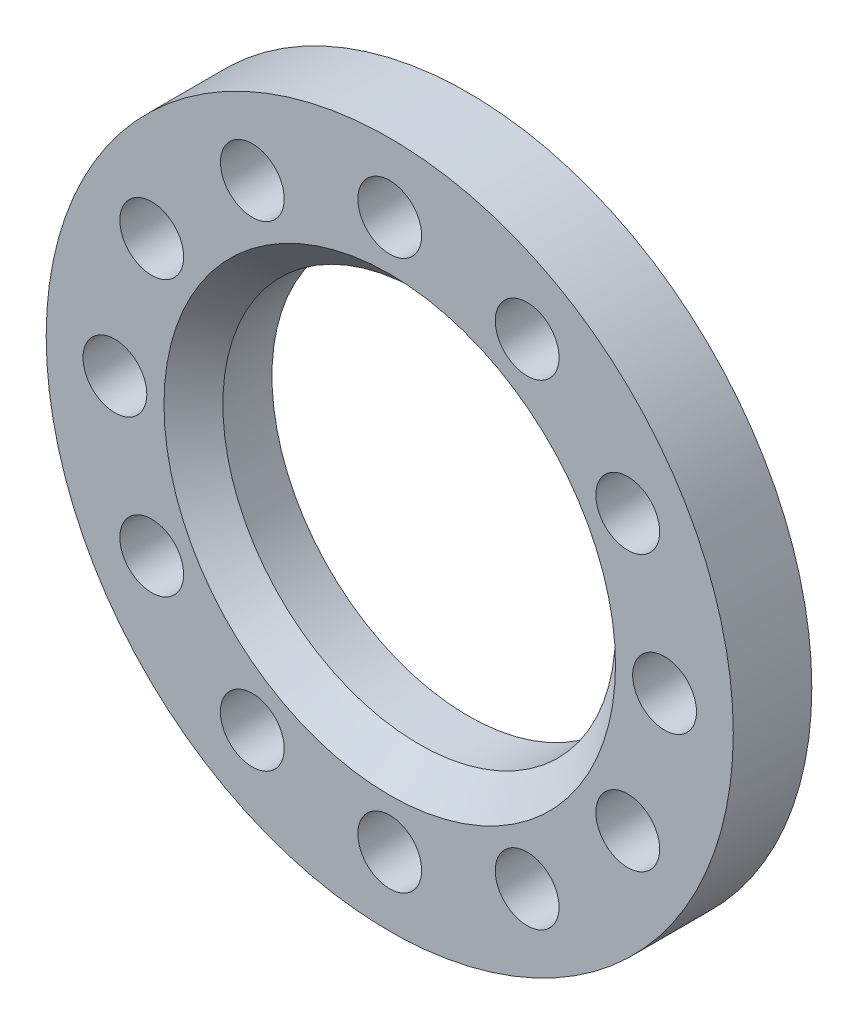
ISO-10303-21;
HEADER;
FILE_DESCRIPTION(('STEP AP214'),'2;1');
FILE_NAME('part.step','',(''),(''),'','','');
FILE_SCHEMA(('AUTOMOTIVE_DESIGN { 1 0 10303 214 1 1 1 1 }'));
ENDSEC;
DATA;
#1=APPLICATION_CONTEXT('core data for automotive mechanical design processes');
#2=APPLICATION_PROTOCOL_DEFINITION('international standard','automotive_design',2000,#1);
#3=PRODUCT_CONTEXT('',#1,'mechanical');
#4=PRODUCT('Part','Part','',(#3));
#5=PRODUCT_RELATED_PRODUCT_CATEGORY('part','',(#4));
#6=PRODUCT_DEFINITION_FORMATION('','',#4);
#7=PRODUCT_DEFINITION_CONTEXT('part definition',#1,'design');
#8=PRODUCT_DEFINITION('design','',#6,#7);
#9=PRODUCT_DEFINITION_SHAPE('','',#8);
#10=(LENGTH_UNIT() NAMED_UNIT(*) SI_UNIT(.MILLI.,.METRE.));
#11=(NAMED_UNIT(*) PLANE_ANGLE_UNIT() SI_UNIT($,.RADIAN.));
#12=(NAMED_UNIT(*) SI_UNIT($,.STERADIAN.) SOLID_ANGLE_UNIT());
#13=UNCERTAINTY_MEASURE_WITH_UNIT(LENGTH_MEASURE(1.E-05),#10,'distance_accuracy_value','');
#14=(GEOMETRIC_REPRESENTATION_CONTEXT(3) GLOBAL_UNCERTAINTY_ASSIGNED_CONTEXT((#13)) GLOBAL_UNIT_ASSIGNED_CONTEXT((#10,
#11,#12)) REPRESENTATION_CONTEXT('',''));
#15=CARTESIAN_POINT('',(0.,0.,0.));
#16=DIRECTION('',(0.,0.,1.));
#17=DIRECTION('',(1.,0.,0.));
#18=AXIS2_PLACEMENT_3D('',#15,#16,#17);
#19=CARTESIAN_POINT('',(0.,0.,-472.));
#20=DIRECTION('',(0.,0.,-1.));
#21=DIRECTION('',(-1.,0.,0.));
#22=AXIS2_PLACEMENT_3D('',#19,#20,#21);
#23=PLANE('',#22);
#24=CARTESIAN_POINT('',(-28.,-1.11022302462516E-13,-472.));
#25=DIRECTION('',(0.,0.,1.));
#26=DIRECTION('',(1.,0.,0.));
#27=AXIS2_PLACEMENT_3D('',#24,#25,#26);
#28=CIRCLE('',#27,3.25);
#29=CARTESIAN_POINT('',(-24.75,-1.11022302462516E-13,-472.));
#30=VERTEX_POINT('',#29);
#31=EDGE_CURVE('E121',#30,#30,#28,.T.);
#32=ORIENTED_EDGE('',*,*,#31,.T.);
#33=EDGE_LOOP('',(#32));
#34=FACE_BOUND('',#33,.T.);
#35=CARTESIAN_POINT('',(-14.,24.2487113059643,-472.));
#36=DIRECTION('',(0.,0.,1.));
#37=DIRECTION('',(1.,0.,0.));
#38=AXIS2_PLACEMENT_3D('',#35,#36,#37);
#39=CIRCLE('',#38,3.25);
#40=CARTESIAN_POINT('',(-10.75,24.2487113059643,-472.));
#41=VERTEX_POINT('',#40);
#42=EDGE_CURVE('E109',#41,#41,#39,.T.);
#43=ORIENTED_EDGE('',*,*,#42,.T.);
#44=EDGE_LOOP('',(#43));
#45=FACE_BOUND('',#44,.T.);
#46=CARTESIAN_POINT('',(24.2487113059641,14.0000000000002,-472.));
#47=DIRECTION('',(0.,0.,1.));
#48=DIRECTION('',(1.,0.,0.));
#49=AXIS2_PLACEMENT_3D('',#46,#47,#48);
#50=CIRCLE('',#49,3.25);
#51=CARTESIAN_POINT('',(27.4987113059641,14.0000000000002,-472.));
#52=VERTEX_POINT('',#51);
#53=EDGE_CURVE('E91',#52,#52,#50,.T.);
#54=ORIENTED_EDGE('',*,*,#53,.T.);
#55=EDGE_LOOP('',(#54));
#56=FACE_BOUND('',#55,.T.);
#57=CARTESIAN_POINT('',(24.2487113059644,-13.9999999999998,-472.));
#58=DIRECTION('',(0.,0.,1.));
#59=DIRECTION('',(1.,0.,0.));
#60=AXIS2_PLACEMENT_3D('',#57,#58,#59);
#61=CIRCLE('',#60,3.25);
#62=CARTESIAN_POINT('',(27.4987113059644,-13.9999999999998,-472.));
#63=VERTEX_POINT('',#62);
#64=EDGE_CURVE('E79',#63,#63,#61,.T.);
#65=ORIENTED_EDGE('',*,*,#64,.T.);
#66=EDGE_LOOP('',(#65));
#67=FACE_BOUND('',#66,.T.);
#68=CARTESIAN_POINT('',(0.,-28.,-472.));
#69=DIRECTION('',(0.,0.,1.));
#70=DIRECTION('',(1.,0.,0.));
#71=AXIS2_PLACEMENT_3D('',#68,#69,#70);
#72=CIRCLE('',#71,3.25);
#73=CARTESIAN_POINT('',(3.25,-28.,-472.));
#74=VERTEX_POINT('',#73);
#75=EDGE_CURVE('E67',#74,#74,#72,.T.);
#76=ORIENTED_EDGE('',*,*,#75,.T.);
#77=EDGE_LOOP('',(#76));
#78=FACE_BOUND('',#77,.T.);
#79=CARTESIAN_POINT('',(-13.9999999999999,-24.2487113059644,-472.));
#80=DIRECTION('',(0.,0.,1.));
#81=DIRECTION('',(1.,0.,0.));
#82=AXIS2_PLACEMENT_3D('',#79,#80,#81);
#83=CIRCLE('',#82,3.25);
#84=CARTESIAN_POINT('',(-10.7499999999999,-24.2487113059644,-472.));
#85=VERTEX_POINT('',#84);
#86=EDGE_CURVE('E61',#85,#85,#83,.T.);
#87=ORIENTED_EDGE('',*,*,#86,.T.);
#88=EDGE_LOOP('',(#87));
#89=FACE_BOUND('',#88,.T.);
#90=CARTESIAN_POINT('',(0.,0.,-472.));
#91=DIRECTION('',(0.,0.,1.));
#92=DIRECTION('',(1.,0.,0.));
#93=AXIS2_PLACEMENT_3D('',#90,#91,#92);
#94=CIRCLE('',#93,19.9999999999999);
#95=CARTESIAN_POINT('',(19.9999999999999,0.,-472.));
#96=VERTEX_POINT('',#95);
#97=EDGE_CURVE('E58',#96,#96,#94,.T.);
#98=ORIENTED_EDGE('',*,*,#97,.T.);
#99=EDGE_LOOP('',(#98));
#100=FACE_BOUND('',#99,.T.);
#101=CARTESIAN_POINT('',(0.,0.,-472.));
#102=DIRECTION('',(0.,0.,1.));
#103=DIRECTION('',(1.,0.,0.));
#104=AXIS2_PLACEMENT_3D('',#101,#102,#103);
#105=CIRCLE('',#104,34.9999999999999);
#106=CARTESIAN_POINT('',(34.9999999999999,0.,-472.));
#107=VERTEX_POINT('',#106);
#108=EDGE_CURVE('E49',#107,#107,#105,.T.);
#109=ORIENTED_EDGE('',*,*,#108,.F.);
#110=EDGE_LOOP('',(#109));
#111=FACE_BOUND('',#110,.T.);
#112=CARTESIAN_POINT('',(14.0000000000002,-24.2487113059642,-472.));
#113=DIRECTION('',(0.,0.,1.));
#114=DIRECTION('',(1.,0.,0.));
#115=AXIS2_PLACEMENT_3D('',#112,#113,#114);
#116=CIRCLE('',#115,3.25);
#117=CARTESIAN_POINT('',(17.2500000000002,-24.2487113059642,-472.));
#118=VERTEX_POINT('',#117);
#119=EDGE_CURVE('E73',#118,#118,#116,.T.);
#120=ORIENTED_EDGE('',*,*,#119,.T.);
#121=EDGE_LOOP('',(#120));
#122=FACE_BOUND('',#121,.T.);
#123=CARTESIAN_POINT('',(28.,3.33066907387547E-13,-472.));
#124=DIRECTION('',(0.,0.,1.));
#125=DIRECTION('',(1.,0.,0.));
#126=AXIS2_PLACEMENT_3D('',#123,#124,#125);
#127=CIRCLE('',#126,3.25);
#128=CARTESIAN_POINT('',(31.25,3.33066907387547E-13,-472.));
#129=VERTEX_POINT('',#128);
#130=EDGE_CURVE('E85',#129,#129,#127,.T.);
#131=ORIENTED_EDGE('',*,*,#130,.T.);
#132=EDGE_LOOP('',(#131));
#133=FACE_BOUND('',#132,.T.);
#134=CARTESIAN_POINT('',(13.9999999999997,24.2487113059645,-472.));
#135=DIRECTION('',(0.,0.,1.));
#136=DIRECTION('',(1.,0.,0.));
#137=AXIS2_PLACEMENT_3D('',#134,#135,#136);
#138=CIRCLE('',#137,3.25);
#139=CARTESIAN_POINT('',(17.2499999999997,24.2487113059645,-472.));
#140=VERTEX_POINT('',#139);
#141=EDGE_CURVE('E97',#140,#140,#138,.T.);
#142=ORIENTED_EDGE('',*,*,#141,.T.);
#143=EDGE_LOOP('',(#142));
#144=FACE_BOUND('',#143,.T.);
#145=CARTESIAN_POINT('',(0.,28.,-472.));
#146=DIRECTION('',(0.,0.,1.));
#147=DIRECTION('',(1.,0.,0.));
#148=AXIS2_PLACEMENT_3D('',#145,#146,#147);
#149=CIRCLE('',#148,3.25);
#150=CARTESIAN_POINT('',(3.25,28.,-472.));
#151=VERTEX_POINT('',#150);
#152=EDGE_CURVE('E103',#151,#151,#149,.T.);
#153=ORIENTED_EDGE('',*,*,#152,.T.);
#154=EDGE_LOOP('',(#153));
#155=FACE_BOUND('',#154,.T.);
#156=CARTESIAN_POINT('',(-24.2487113059643,13.9999999999999,-472.));
#157=DIRECTION('',(0.,0.,1.));
#158=DIRECTION('',(1.,0.,0.));
#159=AXIS2_PLACEMENT_3D('',#156,#157,#158);
#160=CIRCLE('',#159,3.25);
#161=CARTESIAN_POINT('',(-20.9987113059643,13.9999999999999,-472.));
#162=VERTEX_POINT('',#161);
#163=EDGE_CURVE('E115',#162,#162,#160,.T.);
#164=ORIENTED_EDGE('',*,*,#163,.T.);
#165=EDGE_LOOP('',(#164));
#166=FACE_BOUND('',#165,.T.);
#167=CARTESIAN_POINT('',(-24.2487113059642,-14.0000000000001,-472.));
#168=DIRECTION('',(0.,0.,1.));
#169=DIRECTION('',(1.,0.,0.));
#170=AXIS2_PLACEMENT_3D('',#167,#168,#169);
#171=CIRCLE('',#170,3.25);
#172=CARTESIAN_POINT('',(-20.9987113059642,-14.0000000000001,-472.));
#173=VERTEX_POINT('',#172);
#174=EDGE_CURVE('E127',#173,#173,#171,.T.);
#175=ORIENTED_EDGE('',*,*,#174,.T.);
#176=EDGE_LOOP('',(#175));
#177=FACE_BOUND('',#176,.T.);
#178=ADVANCED_FACE('F38',(#34,#45,#56,#67,#78,#89,#100,#111,#122,#133,#144,#155,#166,#177),#23,.T.);
#179=CARTESIAN_POINT('',(0.,0.,0.));
#180=DIRECTION('',(0.,0.,1.));
#181=DIRECTION('',(1.,0.,0.));
#182=AXIS2_PLACEMENT_3D('',#179,#180,#181);
#183=CYLINDRICAL_SURFACE('',#182,34.9999999999999);
#184=ORIENTED_EDGE('',*,*,#108,.T.);
#185=EDGE_LOOP('',(#184));
#186=FACE_BOUND('',#185,.T.);
#187=CARTESIAN_POINT('',(0.,0.,-464.));
#188=DIRECTION('',(0.,0.,1.));
#189=DIRECTION('',(1.,0.,0.));
#190=AXIS2_PLACEMENT_3D('',#187,#188,#189);
#191=CIRCLE('',#190,34.9999999999999);
#192=CARTESIAN_POINT('',(34.9999999999999,0.,-464.));
#193=VERTEX_POINT('',#192);
#194=EDGE_CURVE('E53',#193,#193,#191,.T.);
#195=ORIENTED_EDGE('',*,*,#194,.F.);
#196=EDGE_LOOP('',(#195));
#197=FACE_BOUND('',#196,.T.);
#198=ADVANCED_FACE('F140',(#186,#197),#183,.T.);
#199=CARTESIAN_POINT('',(0.,0.,-464.));
#200=DIRECTION('',(0.,0.,1.));
#201=DIRECTION('',(1.,0.,0.));
#202=AXIS2_PLACEMENT_3D('',#199,#200,#201);
#203=PLANE('',#202);
#204=CARTESIAN_POINT('',(-24.2487113059642,-14.0000000000001,-464.));
#205=DIRECTION('',(0.,0.,1.));
#206=DIRECTION('',(1.,0.,0.));
#207=AXIS2_PLACEMENT_3D('',#204,#205,#206);
#208=CIRCLE('',#207,3.25);
#209=CARTESIAN_POINT('',(-20.9987113059642,-14.0000000000001,-464.));
#210=VERTEX_POINT('',#209);
#211=EDGE_CURVE('E130',#210,#210,#208,.T.);
#212=ORIENTED_EDGE('',*,*,#211,.F.);
#213=EDGE_LOOP('',(#212));
#214=FACE_BOUND('',#213,.T.);
#215=CARTESIAN_POINT('',(-28.,-1.11022302462516E-13,-464.));
#216=DIRECTION('',(0.,0.,1.));
#217=DIRECTION('',(1.,0.,0.));
#218=AXIS2_PLACEMENT_3D('',#215,#216,#217);
#219=CIRCLE('',#218,3.25);
#220=CARTESIAN_POINT('',(-24.75,-1.11022302462516E-13,-464.));
#221=VERTEX_POINT('',#220);
#222=EDGE_CURVE('E124',#221,#221,#219,.T.);
#223=ORIENTED_EDGE('',*,*,#222,.F.);
#224=EDGE_LOOP('',(#223));
#225=FACE_BOUND('',#224,.T.);
#226=CARTESIAN_POINT('',(-24.2487113059643,13.9999999999999,-464.));
#227=DIRECTION('',(0.,0.,1.));
#228=DIRECTION('',(1.,0.,0.));
#229=AXIS2_PLACEMENT_3D('',#226,#227,#228);
#230=CIRCLE('',#229,3.25);
#231=CARTESIAN_POINT('',(-20.9987113059643,13.9999999999999,-464.));
#232=VERTEX_POINT('',#231);
#233=EDGE_CURVE('E118',#232,#232,#230,.T.);
#234=ORIENTED_EDGE('',*,*,#233,.F.);
#235=EDGE_LOOP('',(#234));
#236=FACE_BOUND('',#235,.T.);
#237=CARTESIAN_POINT('',(-14.,24.2487113059643,-464.));
#238=DIRECTION('',(0.,0.,1.));
#239=DIRECTION('',(1.,0.,0.));
#240=AXIS2_PLACEMENT_3D('',#237,#238,#239);
#241=CIRCLE('',#240,3.25);
#242=CARTESIAN_POINT('',(-10.75,24.2487113059643,-464.));
#243=VERTEX_POINT('',#242);
#244=EDGE_CURVE('E112',#243,#243,#241,.T.);
#245=ORIENTED_EDGE('',*,*,#244,.F.);
#246=EDGE_LOOP('',(#245));
#247=FACE_BOUND('',#246,.T.);
#248=CARTESIAN_POINT('',(0.,28.,-464.));
#249=DIRECTION('',(0.,0.,1.));
#250=DIRECTION('',(1.,0.,0.));
#251=AXIS2_PLACEMENT_3D('',#248,#249,#250);
#252=CIRCLE('',#251,3.25);
#253=CARTESIAN_POINT('',(3.25,28.,-464.));
#254=VERTEX_POINT('',#253);
#255=EDGE_CURVE('E106',#254,#254,#252,.T.);
#256=ORIENTED_EDGE('',*,*,#255,.F.);
#257=EDGE_LOOP('',(#256));
#258=FACE_BOUND('',#257,.T.);
#259=CARTESIAN_POINT('',(13.9999999999997,24.2487113059645,-464.));
#260=DIRECTION('',(0.,0.,1.));
#261=DIRECTION('',(1.,0.,0.));
#262=AXIS2_PLACEMENT_3D('',#259,#260,#261);
#263=CIRCLE('',#262,3.25);
#264=CARTESIAN_POINT('',(17.2499999999997,24.2487113059645,-464.));
#265=VERTEX_POINT('',#264);
#266=EDGE_CURVE('E100',#265,#265,#263,.T.);
#267=ORIENTED_EDGE('',*,*,#266,.F.);
#268=EDGE_LOOP('',(#267));
#269=FACE_BOUND('',#268,.T.);
#270=CARTESIAN_POINT('',(24.2487113059641,14.0000000000002,-464.));
#271=DIRECTION('',(0.,0.,1.));
#272=DIRECTION('',(1.,0.,0.));
#273=AXIS2_PLACEMENT_3D('',#270,#271,#272);
#274=CIRCLE('',#273,3.25);
#275=CARTESIAN_POINT('',(27.4987113059641,14.0000000000002,-464.));
#276=VERTEX_POINT('',#275);
#277=EDGE_CURVE('E94',#276,#276,#274,.T.);
#278=ORIENTED_EDGE('',*,*,#277,.F.);
#279=EDGE_LOOP('',(#278));
#280=FACE_BOUND('',#279,.T.);
#281=CARTESIAN_POINT('',(28.,3.33066907387547E-13,-464.));
#282=DIRECTION('',(0.,0.,1.));
#283=DIRECTION('',(1.,0.,0.));
#284=AXIS2_PLACEMENT_3D('',#281,#282,#283);
#285=CIRCLE('',#284,3.25);
#286=CARTESIAN_POINT('',(31.25,3.33066907387547E-13,-464.));
#287=VERTEX_POINT('',#286);
#288=EDGE_CURVE('E88',#287,#287,#285,.T.);
#289=ORIENTED_EDGE('',*,*,#288,.F.);
#290=EDGE_LOOP('',(#289));
#291=FACE_BOUND('',#290,.T.);
#292=CARTESIAN_POINT('',(24.2487113059644,-13.9999999999998,-464.));
#293=DIRECTION('',(0.,0.,1.));
#294=DIRECTION('',(1.,0.,0.));
#295=AXIS2_PLACEMENT_3D('',#292,#293,#294);
#296=CIRCLE('',#295,3.25);
#297=CARTESIAN_POINT('',(27.4987113059644,-13.9999999999998,-464.));
#298=VERTEX_POINT('',#297);
#299=EDGE_CURVE('E82',#298,#298,#296,.T.);
#300=ORIENTED_EDGE('',*,*,#299,.F.);
#301=EDGE_LOOP('',(#300));
#302=FACE_BOUND('',#301,.T.);
#303=CARTESIAN_POINT('',(14.0000000000002,-24.2487113059642,-464.));
#304=DIRECTION('',(0.,0.,1.));
#305=DIRECTION('',(1.,0.,0.));
#306=AXIS2_PLACEMENT_3D('',#303,#304,#305);
#307=CIRCLE('',#306,3.25);
#308=CARTESIAN_POINT('',(17.2500000000002,-24.2487113059642,-464.));
#309=VERTEX_POINT('',#308);
#310=EDGE_CURVE('E76',#309,#309,#307,.T.);
#311=ORIENTED_EDGE('',*,*,#310,.F.);
#312=EDGE_LOOP('',(#311));
#313=FACE_BOUND('',#312,.T.);
#314=CARTESIAN_POINT('',(0.,-28.,-464.));
#315=DIRECTION('',(0.,0.,1.));
#316=DIRECTION('',(1.,0.,0.));
#317=AXIS2_PLACEMENT_3D('',#314,#315,#316);
#318=CIRCLE('',#317,3.25);
#319=CARTESIAN_POINT('',(3.25,-28.,-464.));
#320=VERTEX_POINT('',#319);
#321=EDGE_CURVE('E70',#320,#320,#318,.T.);
#322=ORIENTED_EDGE('',*,*,#321,.F.);
#323=EDGE_LOOP('',(#322));
#324=FACE_BOUND('',#323,.T.);
#325=CARTESIAN_POINT('',(-13.9999999999999,-24.2487113059644,-464.));
#326=DIRECTION('',(0.,0.,1.));
#327=DIRECTION('',(1.,0.,0.));
#328=AXIS2_PLACEMENT_3D('',#325,#326,#327);
#329=CIRCLE('',#328,3.25);
#330=CARTESIAN_POINT('',(-10.7499999999999,-24.2487113059644,-464.));
#331=VERTEX_POINT('',#330);
#332=EDGE_CURVE('E64',#331,#331,#329,.T.);
#333=ORIENTED_EDGE('',*,*,#332,.F.);
#334=EDGE_LOOP('',(#333));
#335=FACE_BOUND('',#334,.T.);
#336=CARTESIAN_POINT('',(0.,0.,-464.));
#337=DIRECTION('',(0.,0.,1.));
#338=DIRECTION('',(1.,0.,0.));
#339=AXIS2_PLACEMENT_3D('',#336,#337,#338);
#340=CIRCLE('',#339,22.9999999999999);
#341=CARTESIAN_POINT('',(22.9999999999999,0.,-464.));
#342=VERTEX_POINT('',#341);
#343=EDGE_CURVE('E11',#342,#342,#340,.F.);
#344=ORIENTED_EDGE('',*,*,#343,.T.);
#345=EDGE_LOOP('',(#344));
#346=FACE_BOUND('',#345,.T.);
#347=ORIENTED_EDGE('',*,*,#194,.T.);
#348=EDGE_LOOP('',(#347));
#349=FACE_BOUND('',#348,.T.);
#350=ADVANCED_FACE('F136',(#214,#225,#236,#247,#258,#269,#280,#291,#302,#313,#324,#335,#346,
#349),#203,.T.);
#351=CARTESIAN_POINT('',(0.,0.,0.));
#352=DIRECTION('',(0.,0.,1.));
#353=DIRECTION('',(1.,0.,0.));
#354=AXIS2_PLACEMENT_3D('',#351,#352,#353);
#355=CYLINDRICAL_SURFACE('',#354,19.9999999999999);
#356=CARTESIAN_POINT('',(0.,0.,-467.));
#357=DIRECTION('',(0.,0.,1.));
#358=DIRECTION('',(1.,0.,0.));
#359=AXIS2_PLACEMENT_3D('',#356,#357,#358);
#360=CIRCLE('',#359,19.9999999999999);
#361=CARTESIAN_POINT('',(19.9999999999999,0.,-467.));
#362=VERTEX_POINT('',#361);
#363=EDGE_CURVE('E45',#362,#362,#360,.T.);
#364=ORIENTED_EDGE('',*,*,#363,.T.);
#365=EDGE_LOOP('',(#364));
#366=FACE_BOUND('',#365,.T.);
#367=ORIENTED_EDGE('',*,*,#97,.F.);
#368=EDGE_LOOP('',(#367));
#369=FACE_BOUND('',#368,.T.);
#370=ADVANCED_FACE('F139',(#366,#369),#355,.F.);
#371=CARTESIAN_POINT('',(0.,0.,-467.));
#372=DIRECTION('',(0.,0.,1.));
#373=DIRECTION('',(1.,0.,0.));
#374=AXIS2_PLACEMENT_3D('',#371,#372,#373);
#375=CONICAL_SURFACE('',#374,19.9999999999999,0.785398163397447);
#376=ORIENTED_EDGE('',*,*,#343,.F.);
#377=EDGE_LOOP('',(#376));
#378=FACE_BOUND('',#377,.T.);
#379=ORIENTED_EDGE('',*,*,#363,.F.);
#380=EDGE_LOOP('',(#379));
#381=FACE_BOUND('',#380,.T.);
#382=ADVANCED_FACE('F40',(#378,#381),#375,.F.);
#383=CARTESIAN_POINT('',(-13.9999999999999,-24.2487113059644,-464.));
#384=DIRECTION('',(0.,0.,1.));
#385=DIRECTION('',(1.,0.,0.));
#386=AXIS2_PLACEMENT_3D('',#383,#384,#385);
#387=CYLINDRICAL_SURFACE('',#386,3.25);
#388=ORIENTED_EDGE('',*,*,#86,.F.);
#389=EDGE_LOOP('',(#388));
#390=FACE_BOUND('',#389,.T.);
#391=ORIENTED_EDGE('',*,*,#332,.T.);
#392=EDGE_LOOP('',(#391));
#393=FACE_BOUND('',#392,.T.);
#394=ADVANCED_FACE('F176',(#390,#393),#387,.F.);
#395=CARTESIAN_POINT('',(0.,-28.,-464.));
#396=DIRECTION('',(0.,0.,1.));
#397=DIRECTION('',(1.,0.,0.));
#398=AXIS2_PLACEMENT_3D('',#395,#396,#397);
#399=CYLINDRICAL_SURFACE('',#398,3.25);
#400=ORIENTED_EDGE('',*,*,#75,.F.);
#401=EDGE_LOOP('',(#400));
#402=FACE_BOUND('',#401,.T.);
#403=ORIENTED_EDGE('',*,*,#321,.T.);
#404=EDGE_LOOP('',(#403));
#405=FACE_BOUND('',#404,.T.);
#406=ADVANCED_FACE('F179',(#402,#405),#399,.F.);
#407=CARTESIAN_POINT('',(14.0000000000002,-24.2487113059642,-464.));
#408=DIRECTION('',(0.,0.,1.));
#409=DIRECTION('',(1.,0.,0.));
#410=AXIS2_PLACEMENT_3D('',#407,#408,#409);
#411=CYLINDRICAL_SURFACE('',#410,3.25);
#412=ORIENTED_EDGE('',*,*,#119,.F.);
#413=EDGE_LOOP('',(#412));
#414=FACE_BOUND('',#413,.T.);
#415=ORIENTED_EDGE('',*,*,#310,.T.);
#416=EDGE_LOOP('',(#415));
#417=FACE_BOUND('',#416,.T.);
#418=ADVANCED_FACE('F183',(#414,#417),#411,.F.);
#419=CARTESIAN_POINT('',(24.2487113059644,-13.9999999999998,-464.));
#420=DIRECTION('',(0.,0.,1.));
#421=DIRECTION('',(1.,0.,0.));
#422=AXIS2_PLACEMENT_3D('',#419,#420,#421);
#423=CYLINDRICAL_SURFACE('',#422,3.25);
#424=ORIENTED_EDGE('',*,*,#64,.F.);
#425=EDGE_LOOP('',(#424));
#426=FACE_BOUND('',#425,.T.);
#427=ORIENTED_EDGE('',*,*,#299,.T.);
#428=EDGE_LOOP('',(#427));
#429=FACE_BOUND('',#428,.T.);
#430=ADVANCED_FACE('F187',(#426,#429),#423,.F.);
#431=CARTESIAN_POINT('',(28.,3.33066907387547E-13,-464.));
#432=DIRECTION('',(0.,0.,1.));
#433=DIRECTION('',(1.,0.,0.));
#434=AXIS2_PLACEMENT_3D('',#431,#432,#433);
#435=CYLINDRICAL_SURFACE('',#434,3.25);
#436=ORIENTED_EDGE('',*,*,#130,.F.);
#437=EDGE_LOOP('',(#436));
#438=FACE_BOUND('',#437,.T.);
#439=ORIENTED_EDGE('',*,*,#288,.T.);
#440=EDGE_LOOP('',(#439));
#441=FACE_BOUND('',#440,.T.);
#442=ADVANCED_FACE('F191',(#438,#441),#435,.F.);
#443=CARTESIAN_POINT('',(24.2487113059641,14.0000000000002,-464.));
#444=DIRECTION('',(0.,0.,1.));
#445=DIRECTION('',(1.,0.,0.));
#446=AXIS2_PLACEMENT_3D('',#443,#444,#445);
#447=CYLINDRICAL_SURFACE('',#446,3.25);
#448=ORIENTED_EDGE('',*,*,#53,.F.);
#449=EDGE_LOOP('',(#448));
#450=FACE_BOUND('',#449,.T.);
#451=ORIENTED_EDGE('',*,*,#277,.T.);
#452=EDGE_LOOP('',(#451));
#453=FACE_BOUND('',#452,.T.);
#454=ADVANCED_FACE('F195',(#450,#453),#447,.F.);
#455=CARTESIAN_POINT('',(13.9999999999997,24.2487113059645,-464.));
#456=DIRECTION('',(0.,0.,1.));
#457=DIRECTION('',(1.,0.,0.));
#458=AXIS2_PLACEMENT_3D('',#455,#456,#457);
#459=CYLINDRICAL_SURFACE('',#458,3.25);
#460=ORIENTED_EDGE('',*,*,#141,.F.);
#461=EDGE_LOOP('',(#460));
#462=FACE_BOUND('',#461,.T.);
#463=ORIENTED_EDGE('',*,*,#266,.T.);
#464=EDGE_LOOP('',(#463));
#465=FACE_BOUND('',#464,.T.);
#466=ADVANCED_FACE('F199',(#462,#465),#459,.F.);
#467=CARTESIAN_POINT('',(0.,28.,-464.));
#468=DIRECTION('',(0.,0.,1.));
#469=DIRECTION('',(1.,0.,0.));
#470=AXIS2_PLACEMENT_3D('',#467,#468,#469);
#471=CYLINDRICAL_SURFACE('',#470,3.25);
#472=ORIENTED_EDGE('',*,*,#152,.F.);
#473=EDGE_LOOP('',(#472));
#474=FACE_BOUND('',#473,.T.);
#475=ORIENTED_EDGE('',*,*,#255,.T.);
#476=EDGE_LOOP('',(#475));
#477=FACE_BOUND('',#476,.T.);
#478=ADVANCED_FACE('F203',(#474,#477),#471,.F.);
#479=CARTESIAN_POINT('',(-14.,24.2487113059643,-464.));
#480=DIRECTION('',(0.,0.,1.));
#481=DIRECTION('',(1.,0.,0.));
#482=AXIS2_PLACEMENT_3D('',#479,#480,#481);
#483=CYLINDRICAL_SURFACE('',#482,3.25);
#484=ORIENTED_EDGE('',*,*,#42,.F.);
#485=EDGE_LOOP('',(#484));
#486=FACE_BOUND('',#485,.T.);
#487=ORIENTED_EDGE('',*,*,#244,.T.);
#488=EDGE_LOOP('',(#487));
#489=FACE_BOUND('',#488,.T.);
#490=ADVANCED_FACE('F207',(#486,#489),#483,.F.);
#491=CARTESIAN_POINT('',(-24.2487113059643,13.9999999999999,-464.));
#492=DIRECTION('',(0.,0.,1.));
#493=DIRECTION('',(1.,0.,0.));
#494=AXIS2_PLACEMENT_3D('',#491,#492,#493);
#495=CYLINDRICAL_SURFACE('',#494,3.25);
#496=ORIENTED_EDGE('',*,*,#163,.F.);
#497=EDGE_LOOP('',(#496));
#498=FACE_BOUND('',#497,.T.);
#499=ORIENTED_EDGE('',*,*,#233,.T.);
#500=EDGE_LOOP('',(#499));
#501=FACE_BOUND('',#500,.T.);
#502=ADVANCED_FACE('F211',(#498,#501),#495,.F.);
#503=CARTESIAN_POINT('',(-28.,-1.11022302462516E-13,-464.));
#504=DIRECTION('',(0.,0.,1.));
#505=DIRECTION('',(1.,0.,0.));
#506=AXIS2_PLACEMENT_3D('',#503,#504,#505);
#507=CYLINDRICAL_SURFACE('',#506,3.25);
#508=ORIENTED_EDGE('',*,*,#31,.F.);
#509=EDGE_LOOP('',(#508));
#510=FACE_BOUND('',#509,.T.);
#511=ORIENTED_EDGE('',*,*,#222,.T.);
#512=EDGE_LOOP('',(#511));
#513=FACE_BOUND('',#512,.T.);
#514=ADVANCED_FACE('F215',(#510,#513),#507,.F.);
#515=CARTESIAN_POINT('',(-24.2487113059642,-14.0000000000001,-464.));
#516=DIRECTION('',(0.,0.,1.));
#517=DIRECTION('',(1.,0.,0.));
#518=AXIS2_PLACEMENT_3D('',#515,#516,#517);
#519=CYLINDRICAL_SURFACE('',#518,3.25);
#520=ORIENTED_EDGE('',*,*,#174,.F.);
#521=EDGE_LOOP('',(#520));
#522=FACE_BOUND('',#521,.T.);
#523=ORIENTED_EDGE('',*,*,#211,.T.);
#524=EDGE_LOOP('',(#523));
#525=FACE_BOUND('',#524,.T.);
#526=ADVANCED_FACE('F134',(#522,#525),#519,.F.);
#527=CLOSED_SHELL('',(#178,#198,#350,#370,#382,#394,#406,#418,#430,#442,#454,#466,#478,#490,
#502,#514,#526));
#528=MANIFOLD_SOLID_BREP('B2',#527);
#529=ADVANCED_BREP_SHAPE_REPRESENTATION('',(#18,#528),#14);
#530=SHAPE_DEFINITION_REPRESENTATION(#9,#529);
ENDSEC;
END-ISO-10303-21;
